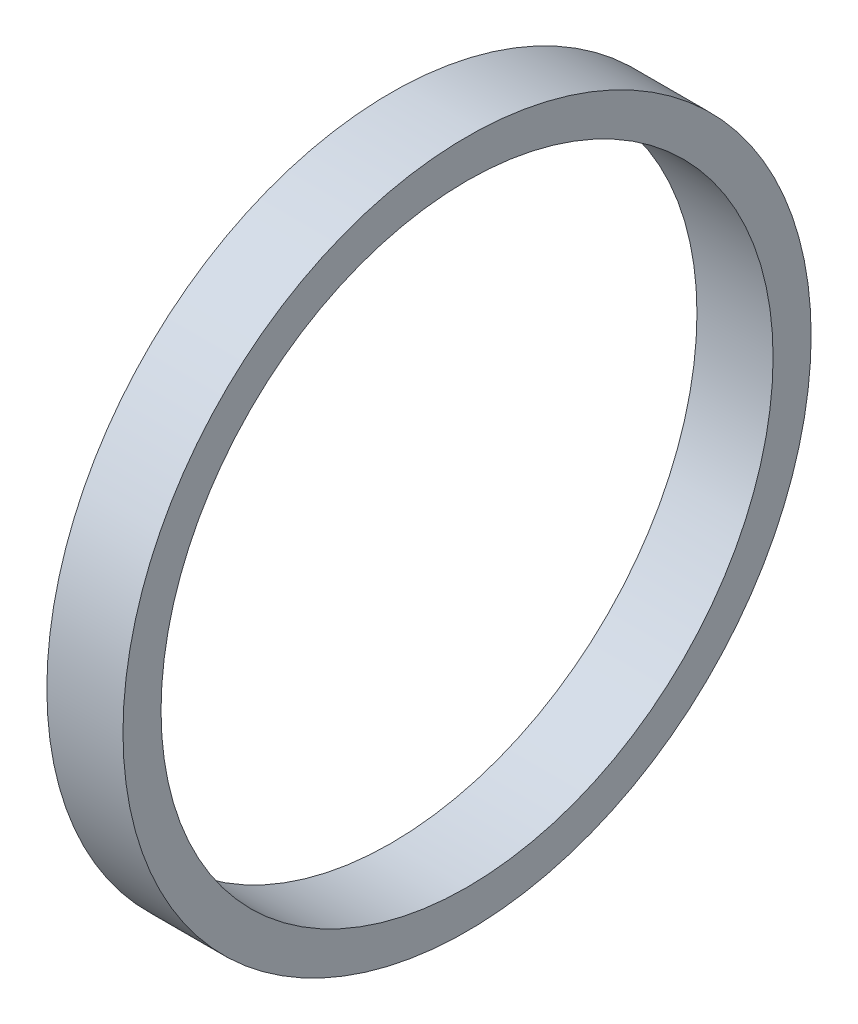
ISO-10303-21;
HEADER;
FILE_DESCRIPTION(('STEP AP214'),'2;1');
FILE_NAME('part.step','',(''),(''),'','','');
FILE_SCHEMA(('AUTOMOTIVE_DESIGN { 1 0 10303 214 1 1 1 1 }'));
ENDSEC;
DATA;
#1=APPLICATION_CONTEXT('core data for automotive mechanical design processes');
#2=APPLICATION_PROTOCOL_DEFINITION('international standard','automotive_design',2000,#1);
#3=PRODUCT_CONTEXT('',#1,'mechanical');
#4=PRODUCT('Part','Part','',(#3));
#5=PRODUCT_RELATED_PRODUCT_CATEGORY('part','',(#4));
#6=PRODUCT_DEFINITION_FORMATION('','',#4);
#7=PRODUCT_DEFINITION_CONTEXT('part definition',#1,'design');
#8=PRODUCT_DEFINITION('design','',#6,#7);
#9=PRODUCT_DEFINITION_SHAPE('','',#8);
#10=(LENGTH_UNIT() NAMED_UNIT(*) SI_UNIT(.MILLI.,.METRE.));
#11=(NAMED_UNIT(*) PLANE_ANGLE_UNIT() SI_UNIT($,.RADIAN.));
#12=(NAMED_UNIT(*) SI_UNIT($,.STERADIAN.) SOLID_ANGLE_UNIT());
#13=UNCERTAINTY_MEASURE_WITH_UNIT(LENGTH_MEASURE(1.E-05),#10,'distance_accuracy_value','');
#14=(GEOMETRIC_REPRESENTATION_CONTEXT(3) GLOBAL_UNCERTAINTY_ASSIGNED_CONTEXT((#13)) GLOBAL_UNIT_ASSIGNED_CONTEXT((#10,
#11,#12)) REPRESENTATION_CONTEXT('',''));
#15=CARTESIAN_POINT('',(0.,0.,0.));
#16=DIRECTION('',(0.,0.,1.));
#17=DIRECTION('',(1.,0.,0.));
#18=AXIS2_PLACEMENT_3D('',#15,#16,#17);
#19=CARTESIAN_POINT('',(6.35,0.,0.));
#20=DIRECTION('',(1.,0.,0.));
#21=DIRECTION('',(0.,0.,-1.));
#22=AXIS2_PLACEMENT_3D('',#19,#20,#21);
#23=PLANE('',#22);
#24=CARTESIAN_POINT('',(6.35,0.,0.));
#25=DIRECTION('',(1.,0.,0.));
#26=DIRECTION('',(0.,0.,-1.));
#27=AXIS2_PLACEMENT_3D('',#24,#25,#26);
#28=CIRCLE('',#27,57.404);
#29=CARTESIAN_POINT('',(6.35,0.,-57.404));
#30=VERTEX_POINT('',#29);
#31=EDGE_CURVE('E10',#30,#30,#28,.T.);
#32=ORIENTED_EDGE('',*,*,#31,.T.);
#33=EDGE_LOOP('',(#32));
#34=FACE_BOUND('',#33,.T.);
#35=CARTESIAN_POINT('',(6.35,0.,0.));
#36=DIRECTION('',(1.,0.,0.));
#37=DIRECTION('',(0.,0.,-1.));
#38=AXIS2_PLACEMENT_3D('',#35,#36,#37);
#39=CIRCLE('',#38,51.054);
#40=CARTESIAN_POINT('',(6.35,0.,-51.054));
#41=VERTEX_POINT('',#40);
#42=EDGE_CURVE('E41',#41,#41,#39,.T.);
#43=ORIENTED_EDGE('',*,*,#42,.F.);
#44=EDGE_LOOP('',(#43));
#45=FACE_BOUND('',#44,.T.);
#46=ADVANCED_FACE('F30',(#34,#45),#23,.T.);
#47=CARTESIAN_POINT('',(-6.35,0.,0.));
#48=DIRECTION('',(1.,0.,0.));
#49=DIRECTION('',(0.,0.,-1.));
#50=AXIS2_PLACEMENT_3D('',#47,#48,#49);
#51=PLANE('',#50);
#52=CARTESIAN_POINT('',(-6.35,0.,0.));
#53=DIRECTION('',(1.,0.,0.));
#54=DIRECTION('',(0.,0.,-1.));
#55=AXIS2_PLACEMENT_3D('',#52,#53,#54);
#56=CIRCLE('',#55,57.404);
#57=CARTESIAN_POINT('',(-6.35,0.,-57.404));
#58=VERTEX_POINT('',#57);
#59=EDGE_CURVE('E34',#58,#58,#56,.T.);
#60=ORIENTED_EDGE('',*,*,#59,.F.);
#61=EDGE_LOOP('',(#60));
#62=FACE_BOUND('',#61,.T.);
#63=CARTESIAN_POINT('',(-6.35,0.,0.));
#64=DIRECTION('',(1.,0.,0.));
#65=DIRECTION('',(0.,0.,-1.));
#66=AXIS2_PLACEMENT_3D('',#63,#64,#65);
#67=CIRCLE('',#66,51.054);
#68=CARTESIAN_POINT('',(-6.35,0.,-51.054));
#69=VERTEX_POINT('',#68);
#70=EDGE_CURVE('E43',#69,#69,#67,.T.);
#71=ORIENTED_EDGE('',*,*,#70,.T.);
#72=EDGE_LOOP('',(#71));
#73=FACE_BOUND('',#72,.T.);
#74=ADVANCED_FACE('F53',(#62,#73),#51,.F.);
#75=CARTESIAN_POINT('',(6.35,0.,0.));
#76=DIRECTION('',(-1.,0.,0.));
#77=DIRECTION('',(0.,0.,1.));
#78=AXIS2_PLACEMENT_3D('',#75,#76,#77);
#79=CYLINDRICAL_SURFACE('',#78,57.404);
#80=ORIENTED_EDGE('',*,*,#31,.F.);
#81=EDGE_LOOP('',(#80));
#82=FACE_BOUND('',#81,.T.);
#83=ORIENTED_EDGE('',*,*,#59,.T.);
#84=EDGE_LOOP('',(#83));
#85=FACE_BOUND('',#84,.T.);
#86=ADVANCED_FACE('F32',(#82,#85),#79,.T.);
#87=CARTESIAN_POINT('',(6.35,0.,0.));
#88=DIRECTION('',(-1.,0.,0.));
#89=DIRECTION('',(0.,0.,1.));
#90=AXIS2_PLACEMENT_3D('',#87,#88,#89);
#91=CYLINDRICAL_SURFACE('',#90,51.054);
#92=ORIENTED_EDGE('',*,*,#42,.T.);
#93=EDGE_LOOP('',(#92));
#94=FACE_BOUND('',#93,.T.);
#95=ORIENTED_EDGE('',*,*,#70,.F.);
#96=EDGE_LOOP('',(#95));
#97=FACE_BOUND('',#96,.T.);
#98=ADVANCED_FACE('F49',(#94,#97),#91,.F.);
#99=CLOSED_SHELL('',(#46,#74,#86,#98));
#100=MANIFOLD_SOLID_BREP('B2',#99);
#101=ADVANCED_BREP_SHAPE_REPRESENTATION('',(#18,#100),#14);
#102=SHAPE_DEFINITION_REPRESENTATION(#9,#101);
ENDSEC;
END-ISO-10303-21;
